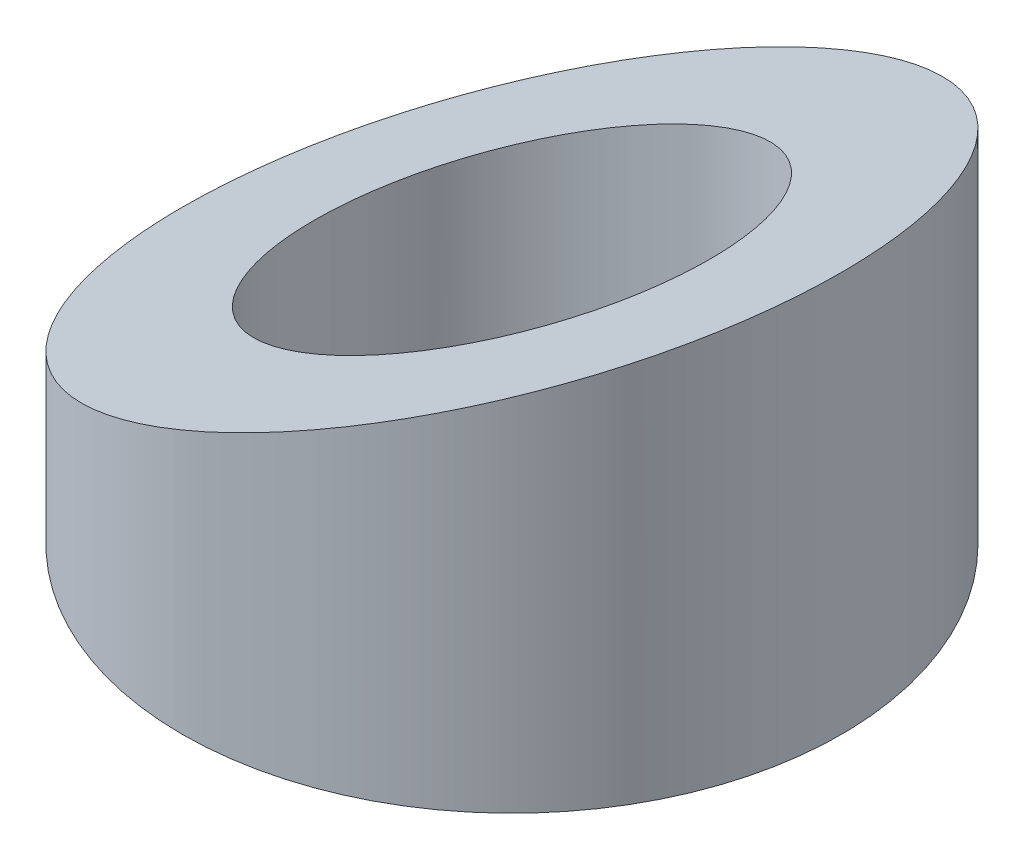
ISO-10303-21;
HEADER;
FILE_DESCRIPTION(('STEP AP214'),'2;1');
FILE_NAME('part.step','',(''),(''),'','','');
FILE_SCHEMA(('AUTOMOTIVE_DESIGN { 1 0 10303 214 1 1 1 1 }'));
ENDSEC;
DATA;
#1=APPLICATION_CONTEXT('core data for automotive mechanical design processes');
#2=APPLICATION_PROTOCOL_DEFINITION('international standard','automotive_design',2000,#1);
#3=PRODUCT_CONTEXT('',#1,'mechanical');
#4=PRODUCT('Part','Part','',(#3));
#5=PRODUCT_RELATED_PRODUCT_CATEGORY('part','',(#4));
#6=PRODUCT_DEFINITION_FORMATION('','',#4);
#7=PRODUCT_DEFINITION_CONTEXT('part definition',#1,'design');
#8=PRODUCT_DEFINITION('design','',#6,#7);
#9=PRODUCT_DEFINITION_SHAPE('','',#8);
#10=(LENGTH_UNIT() NAMED_UNIT(*) SI_UNIT(.MILLI.,.METRE.));
#11=(NAMED_UNIT(*) PLANE_ANGLE_UNIT() SI_UNIT($,.RADIAN.));
#12=(NAMED_UNIT(*) SI_UNIT($,.STERADIAN.) SOLID_ANGLE_UNIT());
#13=UNCERTAINTY_MEASURE_WITH_UNIT(LENGTH_MEASURE(1.E-05),#10,'distance_accuracy_value','');
#14=(GEOMETRIC_REPRESENTATION_CONTEXT(3) GLOBAL_UNCERTAINTY_ASSIGNED_CONTEXT((#13)) GLOBAL_UNIT_ASSIGNED_CONTEXT((#10,
#11,#12)) REPRESENTATION_CONTEXT('',''));
#15=CARTESIAN_POINT('',(0.,0.,0.));
#16=DIRECTION('',(0.,0.,1.));
#17=DIRECTION('',(1.,0.,0.));
#18=AXIS2_PLACEMENT_3D('',#15,#16,#17);
#19=CARTESIAN_POINT('',(0.,20.,0.));
#20=DIRECTION('',(0.,-1.,0.));
#21=DIRECTION('',(0.,0.,-1.));
#22=AXIS2_PLACEMENT_3D('',#19,#20,#21);
#23=CYLINDRICAL_SURFACE('',#22,15.);
#24=CARTESIAN_POINT('',(0.,12.,0.));
#25=DIRECTION('',(0.382683432365091,-0.923879532511287,0.));
#26=DIRECTION('',(-0.923879532511287,-0.382683432365091,0.));
#27=AXIS2_PLACEMENT_3D('',#24,#25,#26);
#28=ELLIPSE('',#27,16.2358830043859,15.);
#29=CARTESIAN_POINT('',(-15.,5.78679656440356,0.));
#30=VERTEX_POINT('',#29);
#31=EDGE_CURVE('E10',#30,#30,#28,.T.);
#32=ORIENTED_EDGE('',*,*,#31,.T.);
#33=EDGE_LOOP('',(#32));
#34=FACE_BOUND('',#33,.T.);
#35=CARTESIAN_POINT('',(0.,0.,0.));
#36=DIRECTION('',(0.,1.,0.));
#37=DIRECTION('',(0.,0.,1.));
#38=AXIS2_PLACEMENT_3D('',#35,#36,#37);
#39=CIRCLE('',#38,15.);
#40=CARTESIAN_POINT('',(0.,0.,15.));
#41=VERTEX_POINT('',#40);
#42=EDGE_CURVE('E39',#41,#41,#39,.T.);
#43=ORIENTED_EDGE('',*,*,#42,.T.);
#44=EDGE_LOOP('',(#43));
#45=FACE_BOUND('',#44,.T.);
#46=ADVANCED_FACE('F32',(#34,#45),#23,.T.);
#47=CARTESIAN_POINT('',(0.,0.,0.));
#48=DIRECTION('',(0.,1.,0.));
#49=DIRECTION('',(0.,0.,1.));
#50=AXIS2_PLACEMENT_3D('',#47,#48,#49);
#51=PLANE('',#50);
#52=CARTESIAN_POINT('',(0.,0.,0.));
#53=DIRECTION('',(0.,-1.,0.));
#54=DIRECTION('',(0.,0.,-1.));
#55=AXIS2_PLACEMENT_3D('',#52,#53,#54);
#56=CIRCLE('',#55,9.);
#57=CARTESIAN_POINT('',(0.,0.,-9.));
#58=VERTEX_POINT('',#57);
#59=EDGE_CURVE('E45',#58,#58,#56,.T.);
#60=ORIENTED_EDGE('',*,*,#59,.F.);
#61=EDGE_LOOP('',(#60));
#62=FACE_BOUND('',#61,.T.);
#63=ORIENTED_EDGE('',*,*,#42,.F.);
#64=EDGE_LOOP('',(#63));
#65=FACE_BOUND('',#64,.T.);
#66=ADVANCED_FACE('F61',(#62,#65),#51,.F.);
#67=CARTESIAN_POINT('',(-15.,5.78679656440356,-16.5));
#68=DIRECTION('',(0.382683432365091,-0.923879532511287,0.));
#69=DIRECTION('',(0.923879532511287,0.382683432365091,0.));
#70=AXIS2_PLACEMENT_3D('',#67,#68,#69);
#71=PLANE('',#70);
#72=CARTESIAN_POINT('',(0.,12.,0.));
#73=DIRECTION('',(0.382683432365091,-0.923879532511287,0.));
#74=DIRECTION('',(-0.923879532511287,-0.382683432365091,0.));
#75=AXIS2_PLACEMENT_3D('',#72,#73,#74);
#76=ELLIPSE('',#75,9.74152980263155,9.);
#77=CARTESIAN_POINT('',(-9.,8.27207793864214,0.));
#78=VERTEX_POINT('',#77);
#79=EDGE_CURVE('E35',#78,#78,#76,.T.);
#80=ORIENTED_EDGE('',*,*,#79,.T.);
#81=EDGE_LOOP('',(#80));
#82=FACE_BOUND('',#81,.T.);
#83=ORIENTED_EDGE('',*,*,#31,.F.);
#84=EDGE_LOOP('',(#83));
#85=FACE_BOUND('',#84,.T.);
#86=ADVANCED_FACE('F52',(#82,#85),#71,.F.);
#87=CARTESIAN_POINT('',(0.,24.5,0.));
#88=DIRECTION('',(0.,-1.,0.));
#89=DIRECTION('',(0.,0.,-1.));
#90=AXIS2_PLACEMENT_3D('',#87,#88,#89);
#91=CYLINDRICAL_SURFACE('',#90,9.);
#92=ORIENTED_EDGE('',*,*,#59,.T.);
#93=EDGE_LOOP('',(#92));
#94=FACE_BOUND('',#93,.T.);
#95=ORIENTED_EDGE('',*,*,#79,.F.);
#96=EDGE_LOOP('',(#95));
#97=FACE_BOUND('',#96,.T.);
#98=ADVANCED_FACE('F55',(#94,#97),#91,.F.);
#99=CLOSED_SHELL('',(#46,#66,#86,#98));
#100=MANIFOLD_SOLID_BREP('B2',#99);
#101=ADVANCED_BREP_SHAPE_REPRESENTATION('',(#18,#100),#14);
#102=SHAPE_DEFINITION_REPRESENTATION(#9,#101);
ENDSEC;
END-ISO-10303-21;
